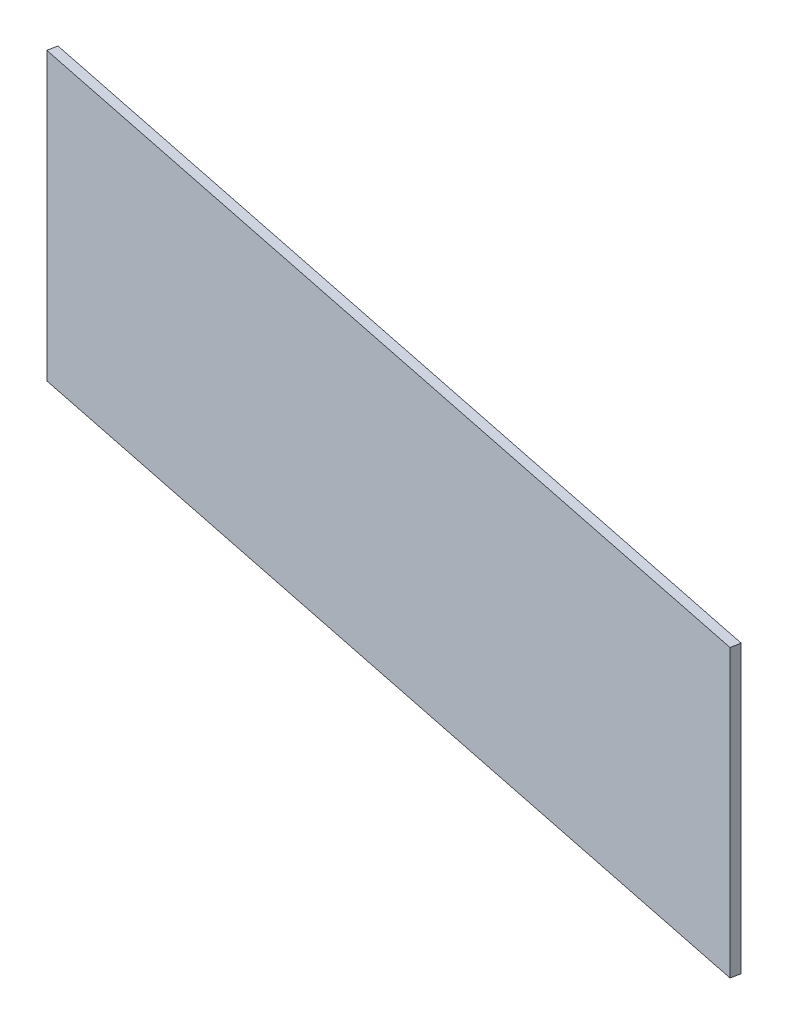
ISO-10303-21;
HEADER;
FILE_DESCRIPTION(('STEP AP214'),'2;1');
FILE_NAME('part.step','',(''),(''),'','','');
FILE_SCHEMA(('AUTOMOTIVE_DESIGN { 1 0 10303 214 1 1 1 1 }'));
ENDSEC;
DATA;
#1=APPLICATION_CONTEXT('core data for automotive mechanical design processes');
#2=APPLICATION_PROTOCOL_DEFINITION('international standard','automotive_design',2000,#1);
#3=PRODUCT_CONTEXT('',#1,'mechanical');
#4=PRODUCT('Part','Part','',(#3));
#5=PRODUCT_RELATED_PRODUCT_CATEGORY('part','',(#4));
#6=PRODUCT_DEFINITION_FORMATION('','',#4);
#7=PRODUCT_DEFINITION_CONTEXT('part definition',#1,'design');
#8=PRODUCT_DEFINITION('design','',#6,#7);
#9=PRODUCT_DEFINITION_SHAPE('','',#8);
#10=(LENGTH_UNIT() NAMED_UNIT(*) SI_UNIT(.MILLI.,.METRE.));
#11=(NAMED_UNIT(*) PLANE_ANGLE_UNIT() SI_UNIT($,.RADIAN.));
#12=(NAMED_UNIT(*) SI_UNIT($,.STERADIAN.) SOLID_ANGLE_UNIT());
#13=UNCERTAINTY_MEASURE_WITH_UNIT(LENGTH_MEASURE(1.E-05),#10,'distance_accuracy_value','');
#14=(GEOMETRIC_REPRESENTATION_CONTEXT(3) GLOBAL_UNCERTAINTY_ASSIGNED_CONTEXT((#13)) GLOBAL_UNIT_ASSIGNED_CONTEXT((#10,
#11,#12)) REPRESENTATION_CONTEXT('',''));
#15=CARTESIAN_POINT('',(0.,0.,0.));
#16=DIRECTION('',(0.,0.,1.));
#17=DIRECTION('',(1.,0.,0.));
#18=AXIS2_PLACEMENT_3D('',#15,#16,#17);
#19=CARTESIAN_POINT('',(-1.5,0.29,1.315));
#20=DIRECTION('',(0.200278154071237,0.,-0.979739078021193));
#21=DIRECTION('',(0.979739078021193,0.,0.200278154071237));
#22=AXIS2_PLACEMENT_3D('',#19,#20,#21);
#23=PLANE('',#22);
#24=DIRECTION('',(-0.979739078021193,0.,-0.200278154071237));
#25=VECTOR('',#24,1.);
#26=CARTESIAN_POINT('',(-0.60000000000011,-0.01,1.49897790055302));
#27=LINE('',#26,#25);
#28=CARTESIAN_POINT('',(-0.600000000000001,-0.01,1.49897790055249));
#29=VERTEX_POINT('',#28);
#30=CARTESIAN_POINT('',(-1.5,-0.01,1.315));
#31=VERTEX_POINT('',#30);
#32=EDGE_CURVE('E11',#29,#31,#27,.T.);
#33=ORIENTED_EDGE('',*,*,#32,.T.);
#34=DIRECTION('',(0.,-1.,0.));
#35=VECTOR('',#34,1.);
#36=CARTESIAN_POINT('',(-1.5,0.29,1.315));
#37=LINE('',#36,#35);
#38=CARTESIAN_POINT('',(-1.5,0.29,1.315));
#39=VERTEX_POINT('',#38);
#40=EDGE_CURVE('E24',#39,#31,#37,.T.);
#41=ORIENTED_EDGE('',*,*,#40,.F.);
#42=DIRECTION('',(0.979739078021193,1.20798335344779E-13,0.200278154071237));
#43=VECTOR('',#42,1.);
#44=CARTESIAN_POINT('',(-1.5,0.29,1.315));
#45=LINE('',#44,#43);
#46=CARTESIAN_POINT('',(-0.60000000000011,0.290000000000111,1.49897790055302));
#47=VERTEX_POINT('',#46);
#48=EDGE_CURVE('E60',#39,#47,#45,.T.);
#49=ORIENTED_EDGE('',*,*,#48,.T.);
#50=DIRECTION('',(0.,-1.,0.));
#51=VECTOR('',#50,1.);
#52=CARTESIAN_POINT('',(-0.600000000000001,0.290000000000111,1.49897790055249));
#53=LINE('',#52,#51);
#54=EDGE_CURVE('E88',#47,#29,#53,.T.);
#55=ORIENTED_EDGE('',*,*,#54,.T.);
#56=EDGE_LOOP('',(#33,#41,#49,#55));
#57=FACE_BOUND('',#56,.T.);
#58=ADVANCED_FACE('F17',(#57),#23,.T.);
#59=CARTESIAN_POINT('',(0.,-0.01,0.));
#60=DIRECTION('',(0.,-1.,0.));
#61=DIRECTION('',(0.,0.,-1.));
#62=AXIS2_PLACEMENT_3D('',#59,#60,#61);
#63=PLANE('',#62);
#64=ORIENTED_EDGE('',*,*,#32,.F.);
#65=DIRECTION('',(0.200278154070647,0.,-0.979739078021314));
#66=VECTOR('',#65,1.);
#67=CARTESIAN_POINT('',(-0.602002781540707,-0.01,1.5087752913327));
#68=LINE('',#67,#66);
#69=CARTESIAN_POINT('',(-0.602002781540707,-0.01,1.5087752913327));
#70=VERTEX_POINT('',#69);
#71=EDGE_CURVE('E85',#70,#29,#68,.T.);
#72=ORIENTED_EDGE('',*,*,#71,.F.);
#73=DIRECTION('',(-0.979739078021312,0.,-0.200278154070655));
#74=VECTOR('',#73,1.);
#75=CARTESIAN_POINT('',(-0.602002781540707,-0.01,1.5087752913327));
#76=LINE('',#75,#74);
#77=CARTESIAN_POINT('',(-1.50200278154071,-0.01,1.32479739078021));
#78=VERTEX_POINT('',#77);
#79=EDGE_CURVE('E63',#70,#78,#76,.T.);
#80=ORIENTED_EDGE('',*,*,#79,.T.);
#81=DIRECTION('',(0.200278154070649,0.,-0.979739078021313));
#82=VECTOR('',#81,1.);
#83=CARTESIAN_POINT('',(-1.50200278154071,-0.01,1.32479739078021));
#84=LINE('',#83,#82);
#85=EDGE_CURVE('E73',#78,#31,#84,.T.);
#86=ORIENTED_EDGE('',*,*,#85,.T.);
#87=EDGE_LOOP('',(#64,#72,#80,#86));
#88=FACE_BOUND('',#87,.T.);
#89=ADVANCED_FACE('F89',(#88),#63,.T.);
#90=CARTESIAN_POINT('',(-0.602002781540707,-0.01,1.5087752913327));
#91=DIRECTION('',(0.979739078021312,0.,0.200278154070655));
#92=DIRECTION('',(0.200278154070655,0.,-0.979739078021312));
#93=AXIS2_PLACEMENT_3D('',#90,#91,#92);
#94=PLANE('',#93);
#95=ORIENTED_EDGE('',*,*,#54,.F.);
#96=DIRECTION('',(0.200278154070657,0.,-0.979739078021312));
#97=VECTOR('',#96,1.);
#98=CARTESIAN_POINT('',(-0.602002781540707,0.29,1.5087752913327));
#99=LINE('',#98,#97);
#100=CARTESIAN_POINT('',(-0.602002781540707,0.29,1.5087752913327));
#101=VERTEX_POINT('',#100);
#102=EDGE_CURVE('E82',#101,#47,#99,.T.);
#103=ORIENTED_EDGE('',*,*,#102,.F.);
#104=DIRECTION('',(0.,-1.,0.));
#105=VECTOR('',#104,1.);
#106=CARTESIAN_POINT('',(-0.602002781540707,0.29,1.5087752913327));
#107=LINE('',#106,#105);
#108=EDGE_CURVE('E64',#101,#70,#107,.T.);
#109=ORIENTED_EDGE('',*,*,#108,.T.);
#110=ORIENTED_EDGE('',*,*,#71,.T.);
#111=EDGE_LOOP('',(#95,#103,#109,#110));
#112=FACE_BOUND('',#111,.T.);
#113=ADVANCED_FACE('F91',(#112),#94,.T.);
#114=CARTESIAN_POINT('',(-0.602002781540707,0.29,1.5087752913327));
#115=DIRECTION('',(0.,1.,0.));
#116=DIRECTION('',(0.,0.,1.));
#117=AXIS2_PLACEMENT_3D('',#114,#115,#116);
#118=PLANE('',#117);
#119=ORIENTED_EDGE('',*,*,#48,.F.);
#120=DIRECTION('',(0.200278154070649,0.,-0.979739078021313));
#121=VECTOR('',#120,1.);
#122=CARTESIAN_POINT('',(-1.50200278154071,0.29,1.32479739078021));
#123=LINE('',#122,#121);
#124=CARTESIAN_POINT('',(-1.50200278154071,0.29,1.32479739078021));
#125=VERTEX_POINT('',#124);
#126=EDGE_CURVE('E54',#125,#39,#123,.T.);
#127=ORIENTED_EDGE('',*,*,#126,.F.);
#128=DIRECTION('',(0.979739078021312,0.,0.200278154070655));
#129=VECTOR('',#128,1.);
#130=CARTESIAN_POINT('',(-1.50200278154071,0.29,1.32479739078021));
#131=LINE('',#130,#129);
#132=EDGE_CURVE('E58',#125,#101,#131,.T.);
#133=ORIENTED_EDGE('',*,*,#132,.T.);
#134=ORIENTED_EDGE('',*,*,#102,.T.);
#135=EDGE_LOOP('',(#119,#127,#133,#134));
#136=FACE_BOUND('',#135,.T.);
#137=ADVANCED_FACE('F56',(#136),#118,.T.);
#138=CARTESIAN_POINT('',(-1.50200278154071,-0.01,1.32479739078021));
#139=DIRECTION('',(-0.979739078021312,0.,-0.200278154070655));
#140=DIRECTION('',(-0.200278154070655,0.,0.979739078021312));
#141=AXIS2_PLACEMENT_3D('',#138,#139,#140);
#142=PLANE('',#141);
#143=ORIENTED_EDGE('',*,*,#40,.T.);
#144=ORIENTED_EDGE('',*,*,#85,.F.);
#145=DIRECTION('',(0.,1.,0.));
#146=VECTOR('',#145,1.);
#147=CARTESIAN_POINT('',(-1.50200278154071,-0.01,1.32479739078021));
#148=LINE('',#147,#146);
#149=EDGE_CURVE('E71',#78,#125,#148,.T.);
#150=ORIENTED_EDGE('',*,*,#149,.T.);
#151=ORIENTED_EDGE('',*,*,#126,.T.);
#152=EDGE_LOOP('',(#143,#144,#150,#151));
#153=FACE_BOUND('',#152,.T.);
#154=ADVANCED_FACE('F76',(#153),#142,.T.);
#155=CARTESIAN_POINT('',(-0.320199529269978,0.,1.5663814810234));
#156=DIRECTION('',(0.200278154070655,0.,-0.979739078021312));
#157=DIRECTION('',(0.979739078021312,0.,0.200278154070655));
#158=AXIS2_PLACEMENT_3D('',#155,#156,#157);
#159=PLANE('',#158);
#160=ORIENTED_EDGE('',*,*,#108,.F.);
#161=ORIENTED_EDGE('',*,*,#132,.F.);
#162=ORIENTED_EDGE('',*,*,#149,.F.);
#163=ORIENTED_EDGE('',*,*,#79,.F.);
#164=EDGE_LOOP('',(#160,#161,#162,#163));
#165=FACE_BOUND('',#164,.T.);
#166=ADVANCED_FACE('F69',(#165),#159,.F.);
#167=CLOSED_SHELL('',(#58,#89,#113,#137,#154,#166));
#168=MANIFOLD_SOLID_BREP('B1',#167);
#169=ADVANCED_BREP_SHAPE_REPRESENTATION('',(#18,#168),#14);
#170=SHAPE_DEFINITION_REPRESENTATION(#9,#169);
ENDSEC;
END-ISO-10303-21;
